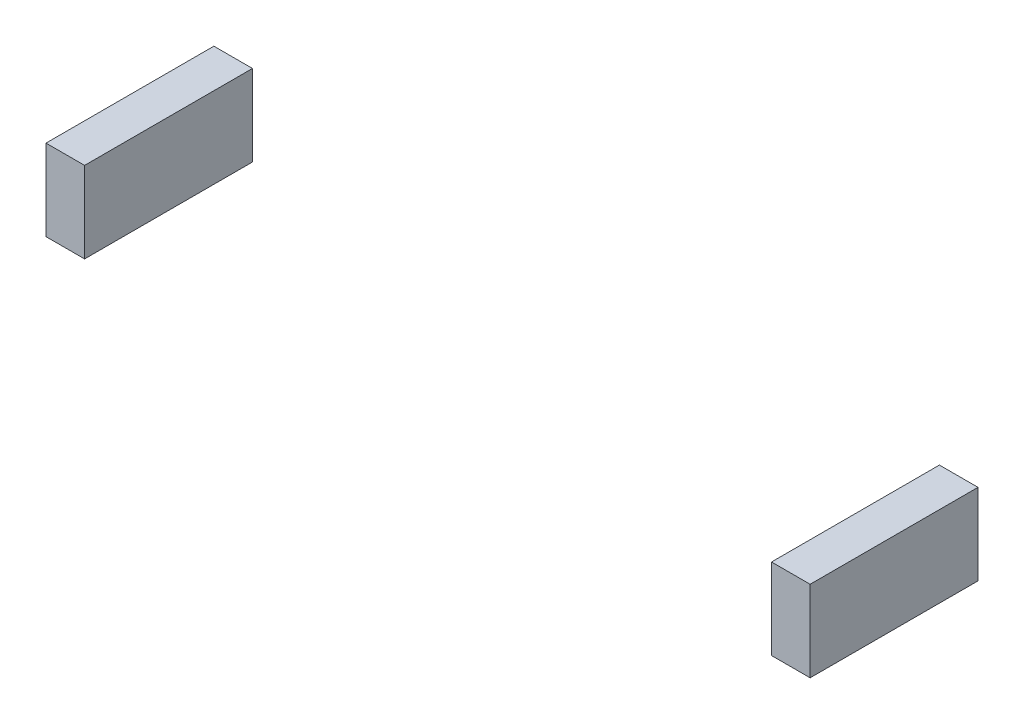
ISO-10303-21;
HEADER;
FILE_DESCRIPTION(('STEP AP214'),'2;1');
FILE_NAME('part.step','',(''),(''),'','','');
FILE_SCHEMA(('AUTOMOTIVE_DESIGN { 1 0 10303 214 1 1 1 1 }'));
ENDSEC;
DATA;
#1=APPLICATION_CONTEXT('core data for automotive mechanical design processes');
#2=APPLICATION_PROTOCOL_DEFINITION('international standard','automotive_design',2000,#1);
#3=PRODUCT_CONTEXT('',#1,'mechanical');
#4=PRODUCT('Part','Part','',(#3));
#5=PRODUCT_RELATED_PRODUCT_CATEGORY('part','',(#4));
#6=PRODUCT_DEFINITION_FORMATION('','',#4);
#7=PRODUCT_DEFINITION_CONTEXT('part definition',#1,'design');
#8=PRODUCT_DEFINITION('design','',#6,#7);
#9=PRODUCT_DEFINITION_SHAPE('','',#8);
#10=(LENGTH_UNIT() NAMED_UNIT(*) SI_UNIT(.MILLI.,.METRE.));
#11=(NAMED_UNIT(*) PLANE_ANGLE_UNIT() SI_UNIT($,.RADIAN.));
#12=(NAMED_UNIT(*) SI_UNIT($,.STERADIAN.) SOLID_ANGLE_UNIT());
#13=UNCERTAINTY_MEASURE_WITH_UNIT(LENGTH_MEASURE(1.E-05),#10,'distance_accuracy_value','');
#14=(GEOMETRIC_REPRESENTATION_CONTEXT(3) GLOBAL_UNCERTAINTY_ASSIGNED_CONTEXT((#13)) GLOBAL_UNIT_ASSIGNED_CONTEXT((#10,
#11,#12)) REPRESENTATION_CONTEXT('',''));
#15=CARTESIAN_POINT('',(0.,0.,0.));
#16=DIRECTION('',(0.,0.,1.));
#17=DIRECTION('',(1.,0.,0.));
#18=AXIS2_PLACEMENT_3D('',#15,#16,#17);
#19=CARTESIAN_POINT('',(-9900.00000000001,-4462.00000000001,-2175.));
#20=DIRECTION('',(0.,0.,1.));
#21=DIRECTION('',(1.,0.,0.));
#22=AXIS2_PLACEMENT_3D('',#19,#20,#21);
#23=PLANE('',#22);
#24=DIRECTION('',(1.,0.,0.));
#25=VECTOR('',#24,1.);
#26=CARTESIAN_POINT('',(-9900.00000000001,-2362.,-2175.));
#27=LINE('',#26,#25);
#28=CARTESIAN_POINT('',(-9900.00000000001,-2362.,-2175.));
#29=VERTEX_POINT('',#28);
#30=CARTESIAN_POINT('',(-8900.00000000001,-2362.,-2175.));
#31=VERTEX_POINT('',#30);
#32=EDGE_CURVE('E103',#29,#31,#27,.T.);
#33=ORIENTED_EDGE('',*,*,#32,.T.);
#34=DIRECTION('',(0.,1.,0.));
#35=VECTOR('',#34,1.);
#36=CARTESIAN_POINT('',(-8900.00000000001,-4462.00000000001,-2175.));
#37=LINE('',#36,#35);
#38=CARTESIAN_POINT('',(-8900.00000000001,-4462.00000000001,-2175.));
#39=VERTEX_POINT('',#38);
#40=EDGE_CURVE('E12',#39,#31,#37,.T.);
#41=ORIENTED_EDGE('',*,*,#40,.F.);
#42=DIRECTION('',(1.,0.,0.));
#43=VECTOR('',#42,1.);
#44=CARTESIAN_POINT('',(-9900.00000000001,-4462.00000000001,-2175.));
#45=LINE('',#44,#43);
#46=CARTESIAN_POINT('',(-9900.00000000001,-4462.00000000001,-2175.));
#47=VERTEX_POINT('',#46);
#48=EDGE_CURVE('E91',#47,#39,#45,.T.);
#49=ORIENTED_EDGE('',*,*,#48,.F.);
#50=DIRECTION('',(0.,1.,0.));
#51=VECTOR('',#50,1.);
#52=CARTESIAN_POINT('',(-9900.00000000001,-4462.00000000001,-2175.));
#53=LINE('',#52,#51);
#54=EDGE_CURVE('E99',#47,#29,#53,.T.);
#55=ORIENTED_EDGE('',*,*,#54,.T.);
#56=EDGE_LOOP('',(#33,#41,#49,#55));
#57=FACE_BOUND('',#56,.T.);
#58=ADVANCED_FACE('F40',(#57),#23,.F.);
#59=CARTESIAN_POINT('',(-8900.00000000001,-4462.00000000001,-2175.));
#60=DIRECTION('',(-1.,0.,0.));
#61=DIRECTION('',(0.,0.,1.));
#62=AXIS2_PLACEMENT_3D('',#59,#60,#61);
#63=PLANE('',#62);
#64=DIRECTION('',(0.,0.,1.));
#65=VECTOR('',#64,1.);
#66=CARTESIAN_POINT('',(-8900.00000000001,-2362.,-2175.));
#67=LINE('',#66,#65);
#68=CARTESIAN_POINT('',(-8900.00000000001,-2362.,2175.));
#69=VERTEX_POINT('',#68);
#70=EDGE_CURVE('E95',#31,#69,#67,.T.);
#71=ORIENTED_EDGE('',*,*,#70,.T.);
#72=DIRECTION('',(0.,1.,0.));
#73=VECTOR('',#72,1.);
#74=CARTESIAN_POINT('',(-8900.00000000001,-4462.00000000001,2175.));
#75=LINE('',#74,#73);
#76=CARTESIAN_POINT('',(-8900.00000000001,-4462.00000000001,2175.));
#77=VERTEX_POINT('',#76);
#78=EDGE_CURVE('E48',#77,#69,#75,.T.);
#79=ORIENTED_EDGE('',*,*,#78,.F.);
#80=DIRECTION('',(0.,0.,1.));
#81=VECTOR('',#80,1.);
#82=CARTESIAN_POINT('',(-8900.00000000001,-4462.00000000001,-2175.));
#83=LINE('',#82,#81);
#84=EDGE_CURVE('E86',#39,#77,#83,.T.);
#85=ORIENTED_EDGE('',*,*,#84,.F.);
#86=ORIENTED_EDGE('',*,*,#40,.T.);
#87=EDGE_LOOP('',(#71,#79,#85,#86));
#88=FACE_BOUND('',#87,.T.);
#89=ADVANCED_FACE('F94',(#88),#63,.F.);
#90=CARTESIAN_POINT('',(-8900.00000000001,-4462.00000000001,2175.));
#91=DIRECTION('',(0.,0.,-1.));
#92=DIRECTION('',(0.,1.,0.));
#93=AXIS2_PLACEMENT_3D('',#90,#91,#92);
#94=PLANE('',#93);
#95=DIRECTION('',(-1.,0.,0.));
#96=VECTOR('',#95,1.);
#97=CARTESIAN_POINT('',(-8900.00000000001,-2362.,2175.));
#98=LINE('',#97,#96);
#99=CARTESIAN_POINT('',(-9900.00000000001,-2362.,2175.));
#100=VERTEX_POINT('',#99);
#101=EDGE_CURVE('E73',#69,#100,#98,.T.);
#102=ORIENTED_EDGE('',*,*,#101,.T.);
#103=DIRECTION('',(0.,1.,0.));
#104=VECTOR('',#103,1.);
#105=CARTESIAN_POINT('',(-9900.00000000001,-4462.00000000001,2175.));
#106=LINE('',#105,#104);
#107=CARTESIAN_POINT('',(-9900.00000000001,-4462.00000000001,2175.));
#108=VERTEX_POINT('',#107);
#109=EDGE_CURVE('E96',#108,#100,#106,.T.);
#110=ORIENTED_EDGE('',*,*,#109,.F.);
#111=DIRECTION('',(-1.,0.,0.));
#112=VECTOR('',#111,1.);
#113=CARTESIAN_POINT('',(-8900.00000000001,-4462.00000000001,2175.));
#114=LINE('',#113,#112);
#115=EDGE_CURVE('E89',#77,#108,#114,.T.);
#116=ORIENTED_EDGE('',*,*,#115,.F.);
#117=ORIENTED_EDGE('',*,*,#78,.T.);
#118=EDGE_LOOP('',(#102,#110,#116,#117));
#119=FACE_BOUND('',#118,.T.);
#120=ADVANCED_FACE('F97',(#119),#94,.F.);
#121=CARTESIAN_POINT('',(-9900.00000000001,-4462.00000000001,2175.));
#122=DIRECTION('',(1.,0.,0.));
#123=DIRECTION('',(0.,0.,-1.));
#124=AXIS2_PLACEMENT_3D('',#121,#122,#123);
#125=PLANE('',#124);
#126=DIRECTION('',(0.,0.,-1.));
#127=VECTOR('',#126,1.);
#128=CARTESIAN_POINT('',(-9900.00000000001,-2362.,2175.));
#129=LINE('',#128,#127);
#130=EDGE_CURVE('E79',#100,#29,#129,.T.);
#131=ORIENTED_EDGE('',*,*,#130,.T.);
#132=ORIENTED_EDGE('',*,*,#54,.F.);
#133=DIRECTION('',(0.,0.,-1.));
#134=VECTOR('',#133,1.);
#135=CARTESIAN_POINT('',(-9900.00000000001,-4462.00000000001,2175.));
#136=LINE('',#135,#134);
#137=EDGE_CURVE('E56',#108,#47,#136,.T.);
#138=ORIENTED_EDGE('',*,*,#137,.F.);
#139=ORIENTED_EDGE('',*,*,#109,.T.);
#140=EDGE_LOOP('',(#131,#132,#138,#139));
#141=FACE_BOUND('',#140,.T.);
#142=ADVANCED_FACE('F110',(#141),#125,.F.);
#143=CARTESIAN_POINT('',(-8900.00000000001,-4462.00000000001,-2175.));
#144=DIRECTION('',(0.,-1.,0.));
#145=DIRECTION('',(0.,0.,-1.));
#146=AXIS2_PLACEMENT_3D('',#143,#144,#145);
#147=PLANE('',#146);
#148=ORIENTED_EDGE('',*,*,#48,.T.);
#149=ORIENTED_EDGE('',*,*,#84,.T.);
#150=ORIENTED_EDGE('',*,*,#115,.T.);
#151=ORIENTED_EDGE('',*,*,#137,.T.);
#152=EDGE_LOOP('',(#148,#149,#150,#151));
#153=FACE_BOUND('',#152,.T.);
#154=ADVANCED_FACE('F87',(#153),#147,.T.);
#155=CARTESIAN_POINT('',(-8900.00000000001,-2362.,-2175.));
#156=DIRECTION('',(0.,-1.,0.));
#157=DIRECTION('',(0.,0.,-1.));
#158=AXIS2_PLACEMENT_3D('',#155,#156,#157);
#159=PLANE('',#158);
#160=ORIENTED_EDGE('',*,*,#32,.F.);
#161=ORIENTED_EDGE('',*,*,#130,.F.);
#162=ORIENTED_EDGE('',*,*,#101,.F.);
#163=ORIENTED_EDGE('',*,*,#70,.F.);
#164=EDGE_LOOP('',(#160,#161,#162,#163));
#165=FACE_BOUND('',#164,.T.);
#166=ADVANCED_FACE('F113',(#165),#159,.F.);
#167=CLOSED_SHELL('',(#58,#89,#120,#142,#154,#166));
#168=MANIFOLD_SOLID_BREP('B2',#167);
#169=CARTESIAN_POINT('',(8900.,-4462.,-2175.));
#170=DIRECTION('',(0.,0.,1.));
#171=DIRECTION('',(0.,-1.,0.));
#172=AXIS2_PLACEMENT_3D('',#169,#170,#171);
#173=PLANE('',#172);
#174=DIRECTION('',(1.,0.,0.));
#175=VECTOR('',#174,1.);
#176=CARTESIAN_POINT('',(8900.,-2362.,-2175.));
#177=LINE('',#176,#175);
#178=CARTESIAN_POINT('',(8900.,-2362.,-2175.));
#179=VERTEX_POINT('',#178);
#180=CARTESIAN_POINT('',(9900.,-2362.,-2175.));
#181=VERTEX_POINT('',#180);
#182=EDGE_CURVE('E226',#179,#181,#177,.T.);
#183=ORIENTED_EDGE('',*,*,#182,.T.);
#184=DIRECTION('',(0.,1.,0.));
#185=VECTOR('',#184,1.);
#186=CARTESIAN_POINT('',(9900.,-4462.,-2175.));
#187=LINE('',#186,#185);
#188=CARTESIAN_POINT('',(9900.,-4462.,-2175.));
#189=VERTEX_POINT('',#188);
#190=EDGE_CURVE('E38',#189,#181,#187,.T.);
#191=ORIENTED_EDGE('',*,*,#190,.F.);
#192=DIRECTION('',(1.,0.,0.));
#193=VECTOR('',#192,1.);
#194=CARTESIAN_POINT('',(8900.,-4462.,-2175.));
#195=LINE('',#194,#193);
#196=CARTESIAN_POINT('',(8900.,-4462.,-2175.));
#197=VERTEX_POINT('',#196);
#198=EDGE_CURVE('E214',#197,#189,#195,.T.);
#199=ORIENTED_EDGE('',*,*,#198,.F.);
#200=DIRECTION('',(0.,1.,0.));
#201=VECTOR('',#200,1.);
#202=CARTESIAN_POINT('',(8900.,-4462.,-2175.));
#203=LINE('',#202,#201);
#204=EDGE_CURVE('E222',#197,#179,#203,.T.);
#205=ORIENTED_EDGE('',*,*,#204,.T.);
#206=EDGE_LOOP('',(#183,#191,#199,#205));
#207=FACE_BOUND('',#206,.T.);
#208=ADVANCED_FACE('F163',(#207),#173,.F.);
#209=CARTESIAN_POINT('',(9900.,-4462.,-2175.));
#210=DIRECTION('',(-1.,0.,0.));
#211=DIRECTION('',(0.,0.,1.));
#212=AXIS2_PLACEMENT_3D('',#209,#210,#211);
#213=PLANE('',#212);
#214=DIRECTION('',(0.,0.,1.));
#215=VECTOR('',#214,1.);
#216=CARTESIAN_POINT('',(9900.,-2362.,-2175.));
#217=LINE('',#216,#215);
#218=CARTESIAN_POINT('',(9900.,-2362.00000000001,2175.));
#219=VERTEX_POINT('',#218);
#220=EDGE_CURVE('E218',#181,#219,#217,.T.);
#221=ORIENTED_EDGE('',*,*,#220,.T.);
#222=DIRECTION('',(0.,1.,0.));
#223=VECTOR('',#222,1.);
#224=CARTESIAN_POINT('',(9900.,-4462.,2175.));
#225=LINE('',#224,#223);
#226=CARTESIAN_POINT('',(9900.,-4462.,2175.));
#227=VERTEX_POINT('',#226);
#228=EDGE_CURVE('E171',#227,#219,#225,.T.);
#229=ORIENTED_EDGE('',*,*,#228,.F.);
#230=DIRECTION('',(0.,0.,1.));
#231=VECTOR('',#230,1.);
#232=CARTESIAN_POINT('',(9900.,-4462.,-2175.));
#233=LINE('',#232,#231);
#234=EDGE_CURVE('E209',#189,#227,#233,.T.);
#235=ORIENTED_EDGE('',*,*,#234,.F.);
#236=ORIENTED_EDGE('',*,*,#190,.T.);
#237=EDGE_LOOP('',(#221,#229,#235,#236));
#238=FACE_BOUND('',#237,.T.);
#239=ADVANCED_FACE('F217',(#238),#213,.F.);
#240=CARTESIAN_POINT('',(9900.,-4462.,2175.));
#241=DIRECTION('',(0.,0.,-1.));
#242=DIRECTION('',(-1.,0.,0.));
#243=AXIS2_PLACEMENT_3D('',#240,#241,#242);
#244=PLANE('',#243);
#245=DIRECTION('',(-1.,0.,0.));
#246=VECTOR('',#245,1.);
#247=CARTESIAN_POINT('',(9900.,-2362.00000000001,2175.));
#248=LINE('',#247,#246);
#249=CARTESIAN_POINT('',(8900.,-2362.00000000001,2175.));
#250=VERTEX_POINT('',#249);
#251=EDGE_CURVE('E196',#219,#250,#248,.T.);
#252=ORIENTED_EDGE('',*,*,#251,.T.);
#253=DIRECTION('',(0.,1.,0.));
#254=VECTOR('',#253,1.);
#255=CARTESIAN_POINT('',(8900.,-4462.,2175.));
#256=LINE('',#255,#254);
#257=CARTESIAN_POINT('',(8900.,-4462.,2175.));
#258=VERTEX_POINT('',#257);
#259=EDGE_CURVE('E219',#258,#250,#256,.T.);
#260=ORIENTED_EDGE('',*,*,#259,.F.);
#261=DIRECTION('',(-1.,0.,0.));
#262=VECTOR('',#261,1.);
#263=CARTESIAN_POINT('',(9900.,-4462.,2175.));
#264=LINE('',#263,#262);
#265=EDGE_CURVE('E212',#227,#258,#264,.T.);
#266=ORIENTED_EDGE('',*,*,#265,.F.);
#267=ORIENTED_EDGE('',*,*,#228,.T.);
#268=EDGE_LOOP('',(#252,#260,#266,#267));
#269=FACE_BOUND('',#268,.T.);
#270=ADVANCED_FACE('F220',(#269),#244,.F.);
#271=CARTESIAN_POINT('',(8900.,-4462.,2175.));
#272=DIRECTION('',(1.,0.,0.));
#273=DIRECTION('',(0.,0.,-1.));
#274=AXIS2_PLACEMENT_3D('',#271,#272,#273);
#275=PLANE('',#274);
#276=DIRECTION('',(0.,0.,-1.));
#277=VECTOR('',#276,1.);
#278=CARTESIAN_POINT('',(8900.,-2362.00000000001,2175.));
#279=LINE('',#278,#277);
#280=EDGE_CURVE('E202',#250,#179,#279,.T.);
#281=ORIENTED_EDGE('',*,*,#280,.T.);
#282=ORIENTED_EDGE('',*,*,#204,.F.);
#283=DIRECTION('',(0.,0.,-1.));
#284=VECTOR('',#283,1.);
#285=CARTESIAN_POINT('',(8900.,-4462.,2175.));
#286=LINE('',#285,#284);
#287=EDGE_CURVE('E179',#258,#197,#286,.T.);
#288=ORIENTED_EDGE('',*,*,#287,.F.);
#289=ORIENTED_EDGE('',*,*,#259,.T.);
#290=EDGE_LOOP('',(#281,#282,#288,#289));
#291=FACE_BOUND('',#290,.T.);
#292=ADVANCED_FACE('F233',(#291),#275,.F.);
#293=CARTESIAN_POINT('',(9900.,-4462.,-2175.));
#294=DIRECTION('',(0.,-1.,0.));
#295=DIRECTION('',(0.,0.,-1.));
#296=AXIS2_PLACEMENT_3D('',#293,#294,#295);
#297=PLANE('',#296);
#298=ORIENTED_EDGE('',*,*,#198,.T.);
#299=ORIENTED_EDGE('',*,*,#234,.T.);
#300=ORIENTED_EDGE('',*,*,#265,.T.);
#301=ORIENTED_EDGE('',*,*,#287,.T.);
#302=EDGE_LOOP('',(#298,#299,#300,#301));
#303=FACE_BOUND('',#302,.T.);
#304=ADVANCED_FACE('F210',(#303),#297,.T.);
#305=CARTESIAN_POINT('',(9900.,-2362.,-2175.));
#306=DIRECTION('',(0.,-1.,0.));
#307=DIRECTION('',(0.,0.,-1.));
#308=AXIS2_PLACEMENT_3D('',#305,#306,#307);
#309=PLANE('',#308);
#310=ORIENTED_EDGE('',*,*,#182,.F.);
#311=ORIENTED_EDGE('',*,*,#280,.F.);
#312=ORIENTED_EDGE('',*,*,#251,.F.);
#313=ORIENTED_EDGE('',*,*,#220,.F.);
#314=EDGE_LOOP('',(#310,#311,#312,#313));
#315=FACE_BOUND('',#314,.T.);
#316=ADVANCED_FACE('F236',(#315),#309,.F.);
#317=CLOSED_SHELL('',(#208,#239,#270,#292,#304,#316));
#318=MANIFOLD_SOLID_BREP('B6',#317);
#319=ADVANCED_BREP_SHAPE_REPRESENTATION('',(#18,#168,#318),#14);
#320=SHAPE_DEFINITION_REPRESENTATION(#9,#319);
ENDSEC;
END-ISO-10303-21;
